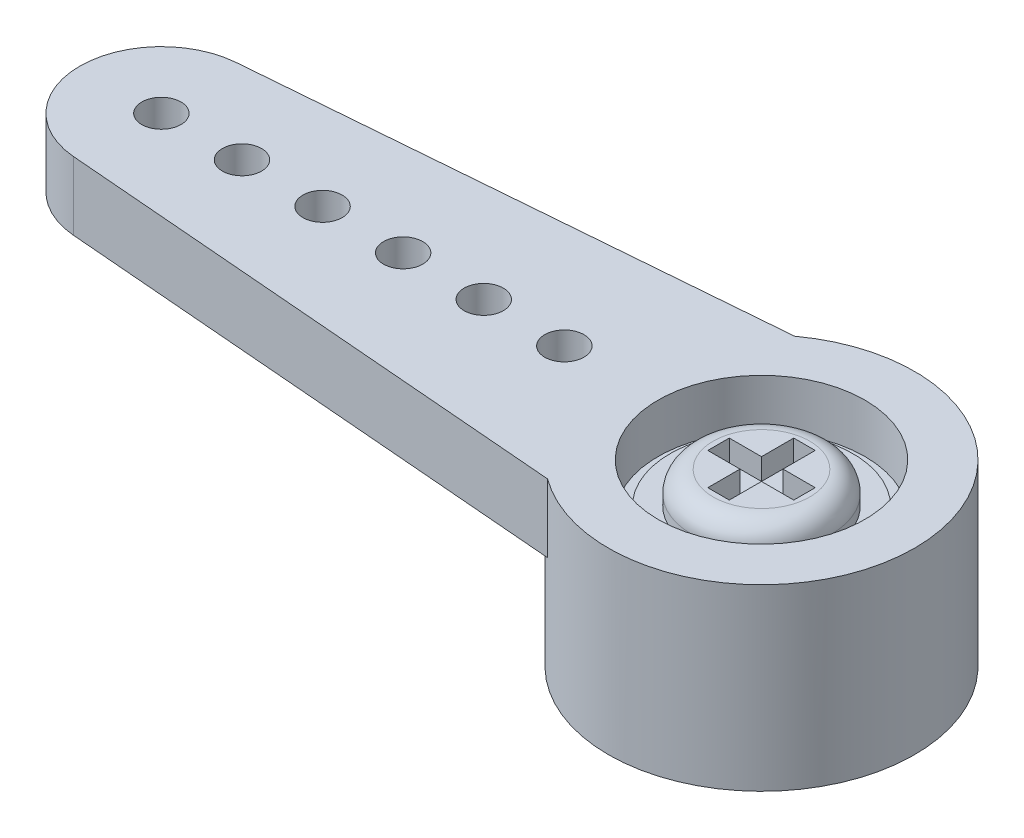
ISO-10303-21;
HEADER;
FILE_DESCRIPTION(('STEP AP214'),'2;1');
FILE_NAME('part.step','',(''),(''),'','','');
FILE_SCHEMA(('AUTOMOTIVE_DESIGN { 1 0 10303 214 1 1 1 1 }'));
ENDSEC;
DATA;
#1=APPLICATION_CONTEXT('core data for automotive mechanical design processes');
#2=APPLICATION_PROTOCOL_DEFINITION('international standard','automotive_design',2000,#1);
#3=PRODUCT_CONTEXT('',#1,'mechanical');
#4=PRODUCT('Part','Part','',(#3));
#5=PRODUCT_RELATED_PRODUCT_CATEGORY('part','',(#4));
#6=PRODUCT_DEFINITION_FORMATION('','',#4);
#7=PRODUCT_DEFINITION_CONTEXT('part definition',#1,'design');
#8=PRODUCT_DEFINITION('design','',#6,#7);
#9=PRODUCT_DEFINITION_SHAPE('','',#8);
#10=(LENGTH_UNIT() NAMED_UNIT(*) SI_UNIT(.MILLI.,.METRE.));
#11=(NAMED_UNIT(*) PLANE_ANGLE_UNIT() SI_UNIT($,.RADIAN.));
#12=(NAMED_UNIT(*) SI_UNIT($,.STERADIAN.) SOLID_ANGLE_UNIT());
#13=UNCERTAINTY_MEASURE_WITH_UNIT(LENGTH_MEASURE(1.E-05),#10,'distance_accuracy_value','');
#14=(GEOMETRIC_REPRESENTATION_CONTEXT(3) GLOBAL_UNCERTAINTY_ASSIGNED_CONTEXT((#13)) GLOBAL_UNIT_ASSIGNED_CONTEXT((#10,
#11,#12)) REPRESENTATION_CONTEXT('',''));
#15=CARTESIAN_POINT('',(0.,0.,0.));
#16=DIRECTION('',(0.,0.,1.));
#17=DIRECTION('',(1.,0.,0.));
#18=AXIS2_PLACEMENT_3D('',#15,#16,#17);
#19=CARTESIAN_POINT('',(0.,0.6604,0.));
#20=DIRECTION('',(0.,1.,0.));
#21=DIRECTION('',(0.,0.,1.));
#22=AXIS2_PLACEMENT_3D('',#19,#20,#21);
#23=PLANE('',#22);
#24=CARTESIAN_POINT('',(0.,0.6604,0.));
#25=DIRECTION('',(0.,1.,0.));
#26=DIRECTION('',(0.,0.,1.));
#27=AXIS2_PLACEMENT_3D('',#24,#25,#26);
#28=CIRCLE('',#27,2.159);
#29=CARTESIAN_POINT('',(0.,0.6604,2.159));
#30=VERTEX_POINT('',#29);
#31=EDGE_CURVE('E264',#30,#30,#28,.T.);
#32=ORIENTED_EDGE('',*,*,#31,.T.);
#33=EDGE_LOOP('',(#32));
#34=FACE_BOUND('',#33,.T.);
#35=CARTESIAN_POINT('',(0.,0.6604,0.));
#36=DIRECTION('',(0.,1.,0.));
#37=DIRECTION('',(0.,0.,1.));
#38=AXIS2_PLACEMENT_3D('',#35,#36,#37);
#39=CIRCLE('',#38,1.651);
#40=CARTESIAN_POINT('',(0.,0.6604,-1.651));
#41=VERTEX_POINT('',#40);
#42=EDGE_CURVE('E241',#41,#41,#39,.T.);
#43=ORIENTED_EDGE('',*,*,#42,.F.);
#44=EDGE_LOOP('',(#43));
#45=FACE_BOUND('',#44,.T.);
#46=ADVANCED_FACE('F34',(#34,#45),#23,.T.);
#47=CARTESIAN_POINT('',(0.,0.4572,0.));
#48=DIRECTION('',(0.,1.,0.));
#49=DIRECTION('',(0.,0.,1.));
#50=AXIS2_PLACEMENT_3D('',#47,#48,#49);
#51=PLANE('',#50);
#52=CARTESIAN_POINT('',(0.,0.4572,0.));
#53=DIRECTION('',(0.,1.,0.));
#54=DIRECTION('',(0.,0.,1.));
#55=AXIS2_PLACEMENT_3D('',#52,#53,#54);
#56=CIRCLE('',#55,2.44475);
#57=CARTESIAN_POINT('',(0.,0.4572,2.44475));
#58=VERTEX_POINT('',#57);
#59=EDGE_CURVE('E276',#58,#58,#56,.T.);
#60=ORIENTED_EDGE('',*,*,#59,.T.);
#61=EDGE_LOOP('',(#60));
#62=FACE_BOUND('',#61,.T.);
#63=CARTESIAN_POINT('',(0.,0.4572,0.));
#64=DIRECTION('',(0.,1.,0.));
#65=DIRECTION('',(0.,0.,1.));
#66=AXIS2_PLACEMENT_3D('',#63,#64,#65);
#67=CIRCLE('',#66,2.159);
#68=CARTESIAN_POINT('',(0.,0.4572,2.159));
#69=VERTEX_POINT('',#68);
#70=EDGE_CURVE('E263',#69,#69,#67,.T.);
#71=ORIENTED_EDGE('',*,*,#70,.F.);
#72=EDGE_LOOP('',(#71));
#73=FACE_BOUND('',#72,.T.);
#74=ADVANCED_FACE('F362',(#62,#73),#51,.T.);
#75=CARTESIAN_POINT('',(0.,-2.6162,0.));
#76=DIRECTION('',(0.,1.,0.));
#77=DIRECTION('',(0.,0.,1.));
#78=AXIS2_PLACEMENT_3D('',#75,#76,#77);
#79=CYLINDRICAL_SURFACE('',#78,1.27);
#80=CARTESIAN_POINT('',(0.,0.4572,0.));
#81=DIRECTION('',(0.,1.,0.));
#82=DIRECTION('',(0.,0.,1.));
#83=AXIS2_PLACEMENT_3D('',#80,#81,#82);
#84=CIRCLE('',#83,1.27);
#85=CARTESIAN_POINT('',(0.,0.4572,1.27));
#86=VERTEX_POINT('',#85);
#87=EDGE_CURVE('E279',#86,#86,#84,.F.);
#88=ORIENTED_EDGE('',*,*,#87,.F.);
#89=EDGE_LOOP('',(#88));
#90=FACE_BOUND('',#89,.T.);
#91=CARTESIAN_POINT('',(0.,-0.2794,0.));
#92=DIRECTION('',(0.,-1.,0.));
#93=DIRECTION('',(0.,0.,-1.));
#94=AXIS2_PLACEMENT_3D('',#91,#92,#93);
#95=CIRCLE('',#94,1.27);
#96=CARTESIAN_POINT('',(0.,-0.2794,-1.27));
#97=VERTEX_POINT('',#96);
#98=EDGE_CURVE('E273',#97,#97,#95,.F.);
#99=ORIENTED_EDGE('',*,*,#98,.F.);
#100=EDGE_LOOP('',(#99));
#101=FACE_BOUND('',#100,.T.);
#102=ADVANCED_FACE('F368',(#90,#101),#79,.F.);
#103=CARTESIAN_POINT('',(0.,1.6129,0.));
#104=DIRECTION('',(0.,-1.,0.));
#105=DIRECTION('',(0.,0.,-1.));
#106=AXIS2_PLACEMENT_3D('',#103,#104,#105);
#107=CYLINDRICAL_SURFACE('',#106,3.6195);
#108=DIRECTION('',(0.,-1.,0.));
#109=VECTOR('',#108,1.);
#110=CARTESIAN_POINT('',(-2.13741415032277,1.6129,2.921));
#111=LINE('',#110,#109);
#112=CARTESIAN_POINT('',(-2.13741415032277,1.6129,2.921));
#113=VERTEX_POINT('',#112);
#114=CARTESIAN_POINT('',(-2.13741415032277,0.,2.921));
#115=VERTEX_POINT('',#114);
#116=EDGE_CURVE('E318',#113,#115,#111,.T.);
#117=ORIENTED_EDGE('',*,*,#116,.T.);
#118=CARTESIAN_POINT('',(0.,0.,0.));
#119=DIRECTION('',(0.,1.,0.));
#120=DIRECTION('',(0.,0.,1.));
#121=AXIS2_PLACEMENT_3D('',#118,#119,#120);
#122=CIRCLE('',#121,3.6195);
#123=CARTESIAN_POINT('',(-2.13741415032277,0.,-2.921));
#124=VERTEX_POINT('',#123);
#125=EDGE_CURVE('E331',#124,#115,#122,.T.);
#126=ORIENTED_EDGE('',*,*,#125,.F.);
#127=DIRECTION('',(0.,-1.,0.));
#128=VECTOR('',#127,1.);
#129=CARTESIAN_POINT('',(-2.13741415032277,1.6129,-2.921));
#130=LINE('',#129,#128);
#131=CARTESIAN_POINT('',(-2.13741415032277,1.6129,-2.921));
#132=VERTEX_POINT('',#131);
#133=EDGE_CURVE('E329',#132,#124,#130,.T.);
#134=ORIENTED_EDGE('',*,*,#133,.F.);
#135=CARTESIAN_POINT('',(0.,1.6129,0.));
#136=DIRECTION('',(0.,1.,0.));
#137=DIRECTION('',(0.,0.,1.));
#138=AXIS2_PLACEMENT_3D('',#135,#136,#137);
#139=CIRCLE('',#138,3.6195);
#140=EDGE_CURVE('E311',#113,#132,#139,.T.);
#141=ORIENTED_EDGE('',*,*,#140,.F.);
#142=EDGE_LOOP('',(#117,#126,#134,#141));
#143=FACE_BOUND('',#142,.T.);
#144=CARTESIAN_POINT('',(0.,-2.6162,0.));
#145=DIRECTION('',(0.,1.,0.));
#146=DIRECTION('',(0.,0.,1.));
#147=AXIS2_PLACEMENT_3D('',#144,#145,#146);
#148=CIRCLE('',#147,3.6195);
#149=CARTESIAN_POINT('',(0.,-2.6162,3.6195));
#150=VERTEX_POINT('',#149);
#151=EDGE_CURVE('E307',#150,#150,#148,.T.);
#152=ORIENTED_EDGE('',*,*,#151,.T.);
#153=EDGE_LOOP('',(#152));
#154=FACE_BOUND('',#153,.T.);
#155=ADVANCED_FACE('F419',(#143,#154),#107,.T.);
#156=CARTESIAN_POINT('',(-14.3430596900559,1.6129,-1.92399194172469));
#157=DIRECTION('',(0.0814130180562945,0.,0.996680450541178));
#158=DIRECTION('',(0.996680450541178,0.,-0.0814130180562945));
#159=AXIS2_PLACEMENT_3D('',#156,#157,#158);
#160=PLANE('',#159);
#161=DIRECTION('',(-0.996680450541178,0.,0.0814130180562945));
#162=VECTOR('',#161,1.);
#163=CARTESIAN_POINT('',(-14.3430596900559,0.,-1.92399194172469));
#164=LINE('',#163,#162);
#165=CARTESIAN_POINT('',(-14.3430596900559,0.,-1.92399194172469));
#166=VERTEX_POINT('',#165);
#167=EDGE_CURVE('E310',#124,#166,#164,.T.);
#168=ORIENTED_EDGE('',*,*,#167,.T.);
#169=DIRECTION('',(0.,-1.,0.));
#170=VECTOR('',#169,1.);
#171=CARTESIAN_POINT('',(-14.3430596900559,1.6129,-1.92399194172469));
#172=LINE('',#171,#170);
#173=CARTESIAN_POINT('',(-14.3430596900559,1.6129,-1.92399194172469));
#174=VERTEX_POINT('',#173);
#175=EDGE_CURVE('E327',#174,#166,#172,.T.);
#176=ORIENTED_EDGE('',*,*,#175,.F.);
#177=DIRECTION('',(-0.996680450541178,0.,0.0814130180562945));
#178=VECTOR('',#177,1.);
#179=CARTESIAN_POINT('',(-14.3430596900559,1.6129,-1.92399194172469));
#180=LINE('',#179,#178);
#181=EDGE_CURVE('E85',#132,#174,#180,.T.);
#182=ORIENTED_EDGE('',*,*,#181,.F.);
#183=ORIENTED_EDGE('',*,*,#133,.T.);
#184=EDGE_LOOP('',(#168,#176,#182,#183));
#185=FACE_BOUND('',#184,.T.);
#186=ADVANCED_FACE('F443',(#185),#160,.F.);
#187=CARTESIAN_POINT('',(-14.1859,1.6129,0.));
#188=DIRECTION('',(0.,-1.,0.));
#189=DIRECTION('',(0.,0.,-1.));
#190=AXIS2_PLACEMENT_3D('',#187,#188,#189);
#191=CYLINDRICAL_SURFACE('',#190,1.9304);
#192=CARTESIAN_POINT('',(-14.1859,0.,0.));
#193=DIRECTION('',(0.,1.,0.));
#194=DIRECTION('',(0.,0.,1.));
#195=AXIS2_PLACEMENT_3D('',#192,#193,#194);
#196=CIRCLE('',#195,1.9304);
#197=CARTESIAN_POINT('',(-14.3430596900559,0.,1.92399194172469));
#198=VERTEX_POINT('',#197);
#199=EDGE_CURVE('E77',#166,#198,#196,.T.);
#200=ORIENTED_EDGE('',*,*,#199,.T.);
#201=DIRECTION('',(0.,-1.,0.));
#202=VECTOR('',#201,1.);
#203=CARTESIAN_POINT('',(-14.3430596900559,1.6129,1.92399194172469));
#204=LINE('',#203,#202);
#205=CARTESIAN_POINT('',(-14.3430596900559,1.6129,1.92399194172469));
#206=VERTEX_POINT('',#205);
#207=EDGE_CURVE('E325',#206,#198,#204,.T.);
#208=ORIENTED_EDGE('',*,*,#207,.F.);
#209=CARTESIAN_POINT('',(-14.1859,1.6129,0.));
#210=DIRECTION('',(0.,1.,0.));
#211=DIRECTION('',(0.,0.,1.));
#212=AXIS2_PLACEMENT_3D('',#209,#210,#211);
#213=CIRCLE('',#212,1.9304);
#214=EDGE_CURVE('E315',#174,#206,#213,.T.);
#215=ORIENTED_EDGE('',*,*,#214,.F.);
#216=ORIENTED_EDGE('',*,*,#175,.T.);
#217=EDGE_LOOP('',(#200,#208,#215,#216));
#218=FACE_BOUND('',#217,.T.);
#219=ADVANCED_FACE('F439',(#218),#191,.T.);
#220=CARTESIAN_POINT('',(-14.3430596900559,1.6129,1.92399194172469));
#221=DIRECTION('',(0.0814130180562943,0.,-0.996680450541178));
#222=DIRECTION('',(-0.996680450541178,0.,-0.0814130180562943));
#223=AXIS2_PLACEMENT_3D('',#220,#221,#222);
#224=PLANE('',#223);
#225=DIRECTION('',(0.996680450541178,0.,0.0814130180562943));
#226=VECTOR('',#225,1.);
#227=CARTESIAN_POINT('',(-14.3430596900559,0.,1.92399194172469));
#228=LINE('',#227,#226);
#229=EDGE_CURVE('E313',#198,#115,#228,.T.);
#230=ORIENTED_EDGE('',*,*,#229,.T.);
#231=ORIENTED_EDGE('',*,*,#116,.F.);
#232=DIRECTION('',(0.996680450541178,0.,0.0814130180562943));
#233=VECTOR('',#232,1.);
#234=CARTESIAN_POINT('',(-14.3430596900559,1.6129,1.92399194172469));
#235=LINE('',#234,#233);
#236=EDGE_CURVE('E58',#206,#113,#235,.T.);
#237=ORIENTED_EDGE('',*,*,#236,.F.);
#238=ORIENTED_EDGE('',*,*,#207,.T.);
#239=EDGE_LOOP('',(#230,#231,#237,#238));
#240=FACE_BOUND('',#239,.T.);
#241=ADVANCED_FACE('F432',(#240),#224,.F.);
#242=CARTESIAN_POINT('',(0.,1.6129,0.));
#243=DIRECTION('',(0.,1.,0.));
#244=DIRECTION('',(0.,0.,1.));
#245=AXIS2_PLACEMENT_3D('',#242,#243,#244);
#246=PLANE('',#245);
#247=CARTESIAN_POINT('',(0.,1.6129,0.));
#248=DIRECTION('',(0.,1.,0.));
#249=DIRECTION('',(0.,0.,1.));
#250=AXIS2_PLACEMENT_3D('',#247,#248,#249);
#251=CIRCLE('',#250,2.44475);
#252=CARTESIAN_POINT('',(0.,1.6129,2.44475));
#253=VERTEX_POINT('',#252);
#254=EDGE_CURVE('E280',#253,#253,#251,.T.);
#255=ORIENTED_EDGE('',*,*,#254,.F.);
#256=EDGE_LOOP('',(#255));
#257=FACE_BOUND('',#256,.T.);
#258=CARTESIAN_POINT('',(-12.2809,1.6129,0.));
#259=DIRECTION('',(0.,1.,0.));
#260=DIRECTION('',(0.,0.,1.));
#261=AXIS2_PLACEMENT_3D('',#258,#259,#260);
#262=CIRCLE('',#261,0.46355);
#263=CARTESIAN_POINT('',(-12.2809,1.6129,0.46355));
#264=VERTEX_POINT('',#263);
#265=EDGE_CURVE('E283',#264,#264,#262,.T.);
#266=ORIENTED_EDGE('',*,*,#265,.F.);
#267=EDGE_LOOP('',(#266));
#268=FACE_BOUND('',#267,.T.);
#269=CARTESIAN_POINT('',(-10.3759,1.6129,0.));
#270=DIRECTION('',(0.,1.,0.));
#271=DIRECTION('',(0.,0.,1.));
#272=AXIS2_PLACEMENT_3D('',#269,#270,#271);
#273=CIRCLE('',#272,0.46355);
#274=CARTESIAN_POINT('',(-10.3759,1.6129,0.46355));
#275=VERTEX_POINT('',#274);
#276=EDGE_CURVE('E287',#275,#275,#273,.T.);
#277=ORIENTED_EDGE('',*,*,#276,.F.);
#278=EDGE_LOOP('',(#277));
#279=FACE_BOUND('',#278,.T.);
#280=CARTESIAN_POINT('',(-8.4709,1.6129,0.));
#281=DIRECTION('',(0.,1.,0.));
#282=DIRECTION('',(0.,0.,1.));
#283=AXIS2_PLACEMENT_3D('',#280,#281,#282);
#284=CIRCLE('',#283,0.46355);
#285=CARTESIAN_POINT('',(-8.4709,1.6129,0.46355));
#286=VERTEX_POINT('',#285);
#287=EDGE_CURVE('E291',#286,#286,#284,.T.);
#288=ORIENTED_EDGE('',*,*,#287,.F.);
#289=EDGE_LOOP('',(#288));
#290=FACE_BOUND('',#289,.T.);
#291=CARTESIAN_POINT('',(-6.5659,1.6129,0.));
#292=DIRECTION('',(0.,1.,0.));
#293=DIRECTION('',(0.,0.,1.));
#294=AXIS2_PLACEMENT_3D('',#291,#292,#293);
#295=CIRCLE('',#294,0.46355);
#296=CARTESIAN_POINT('',(-6.5659,1.6129,0.46355));
#297=VERTEX_POINT('',#296);
#298=EDGE_CURVE('E295',#297,#297,#295,.T.);
#299=ORIENTED_EDGE('',*,*,#298,.F.);
#300=EDGE_LOOP('',(#299));
#301=FACE_BOUND('',#300,.T.);
#302=CARTESIAN_POINT('',(-4.6609,1.6129,0.));
#303=DIRECTION('',(0.,1.,0.));
#304=DIRECTION('',(0.,0.,1.));
#305=AXIS2_PLACEMENT_3D('',#302,#303,#304);
#306=CIRCLE('',#305,0.46355);
#307=CARTESIAN_POINT('',(-4.6609,1.6129,0.46355));
#308=VERTEX_POINT('',#307);
#309=EDGE_CURVE('E299',#308,#308,#306,.T.);
#310=ORIENTED_EDGE('',*,*,#309,.F.);
#311=EDGE_LOOP('',(#310));
#312=FACE_BOUND('',#311,.T.);
#313=CARTESIAN_POINT('',(-14.1859,1.6129,0.));
#314=DIRECTION('',(0.,1.,0.));
#315=DIRECTION('',(0.,0.,1.));
#316=AXIS2_PLACEMENT_3D('',#313,#314,#315);
#317=CIRCLE('',#316,0.46355);
#318=CARTESIAN_POINT('',(-14.1859,1.6129,0.463550000000002));
#319=VERTEX_POINT('',#318);
#320=EDGE_CURVE('E303',#319,#319,#317,.T.);
#321=ORIENTED_EDGE('',*,*,#320,.F.);
#322=EDGE_LOOP('',(#321));
#323=FACE_BOUND('',#322,.T.);
#324=ORIENTED_EDGE('',*,*,#236,.T.);
#325=ORIENTED_EDGE('',*,*,#140,.T.);
#326=ORIENTED_EDGE('',*,*,#181,.T.);
#327=ORIENTED_EDGE('',*,*,#214,.T.);
#328=EDGE_LOOP('',(#324,#325,#326,#327));
#329=FACE_BOUND('',#328,.T.);
#330=ADVANCED_FACE('F429',(#257,#268,#279,#290,#301,#312,#323,#329),#246,.T.);
#331=CARTESIAN_POINT('',(0.,0.,0.));
#332=DIRECTION('',(0.,1.,0.));
#333=DIRECTION('',(0.,0.,1.));
#334=AXIS2_PLACEMENT_3D('',#331,#332,#333);
#335=PLANE('',#334);
#336=CARTESIAN_POINT('',(-12.2809,0.,0.));
#337=DIRECTION('',(0.,1.,0.));
#338=DIRECTION('',(0.,0.,1.));
#339=AXIS2_PLACEMENT_3D('',#336,#337,#338);
#340=CIRCLE('',#339,0.46355);
#341=CARTESIAN_POINT('',(-12.2809,0.,0.46355));
#342=VERTEX_POINT('',#341);
#343=EDGE_CURVE('E286',#342,#342,#340,.T.);
#344=ORIENTED_EDGE('',*,*,#343,.T.);
#345=EDGE_LOOP('',(#344));
#346=FACE_BOUND('',#345,.T.);
#347=CARTESIAN_POINT('',(-10.3759,0.,0.));
#348=DIRECTION('',(0.,1.,0.));
#349=DIRECTION('',(0.,0.,1.));
#350=AXIS2_PLACEMENT_3D('',#347,#348,#349);
#351=CIRCLE('',#350,0.46355);
#352=CARTESIAN_POINT('',(-10.3759,0.,0.46355));
#353=VERTEX_POINT('',#352);
#354=EDGE_CURVE('E290',#353,#353,#351,.T.);
#355=ORIENTED_EDGE('',*,*,#354,.T.);
#356=EDGE_LOOP('',(#355));
#357=FACE_BOUND('',#356,.T.);
#358=CARTESIAN_POINT('',(-8.4709,0.,0.));
#359=DIRECTION('',(0.,1.,0.));
#360=DIRECTION('',(0.,0.,1.));
#361=AXIS2_PLACEMENT_3D('',#358,#359,#360);
#362=CIRCLE('',#361,0.46355);
#363=CARTESIAN_POINT('',(-8.4709,0.,0.46355));
#364=VERTEX_POINT('',#363);
#365=EDGE_CURVE('E294',#364,#364,#362,.T.);
#366=ORIENTED_EDGE('',*,*,#365,.T.);
#367=EDGE_LOOP('',(#366));
#368=FACE_BOUND('',#367,.T.);
#369=CARTESIAN_POINT('',(-6.5659,0.,0.));
#370=DIRECTION('',(0.,1.,0.));
#371=DIRECTION('',(0.,0.,1.));
#372=AXIS2_PLACEMENT_3D('',#369,#370,#371);
#373=CIRCLE('',#372,0.46355);
#374=CARTESIAN_POINT('',(-6.5659,0.,0.46355));
#375=VERTEX_POINT('',#374);
#376=EDGE_CURVE('E298',#375,#375,#373,.T.);
#377=ORIENTED_EDGE('',*,*,#376,.T.);
#378=EDGE_LOOP('',(#377));
#379=FACE_BOUND('',#378,.T.);
#380=CARTESIAN_POINT('',(-4.6609,0.,0.));
#381=DIRECTION('',(0.,1.,0.));
#382=DIRECTION('',(0.,0.,1.));
#383=AXIS2_PLACEMENT_3D('',#380,#381,#382);
#384=CIRCLE('',#383,0.46355);
#385=CARTESIAN_POINT('',(-4.6609,0.,0.46355));
#386=VERTEX_POINT('',#385);
#387=EDGE_CURVE('E302',#386,#386,#384,.T.);
#388=ORIENTED_EDGE('',*,*,#387,.T.);
#389=EDGE_LOOP('',(#388));
#390=FACE_BOUND('',#389,.T.);
#391=CARTESIAN_POINT('',(-14.1859,0.,0.));
#392=DIRECTION('',(0.,1.,0.));
#393=DIRECTION('',(0.,0.,1.));
#394=AXIS2_PLACEMENT_3D('',#391,#392,#393);
#395=CIRCLE('',#394,0.46355);
#396=CARTESIAN_POINT('',(-14.1859,0.,0.463550000000002));
#397=VERTEX_POINT('',#396);
#398=EDGE_CURVE('E306',#397,#397,#395,.T.);
#399=ORIENTED_EDGE('',*,*,#398,.T.);
#400=EDGE_LOOP('',(#399));
#401=FACE_BOUND('',#400,.T.);
#402=ORIENTED_EDGE('',*,*,#167,.F.);
#403=ORIENTED_EDGE('',*,*,#125,.T.);
#404=ORIENTED_EDGE('',*,*,#229,.F.);
#405=ORIENTED_EDGE('',*,*,#199,.F.);
#406=EDGE_LOOP('',(#402,#403,#404,#405));
#407=FACE_BOUND('',#406,.T.);
#408=ADVANCED_FACE('F427',(#346,#357,#368,#379,#390,#401,#407),#335,.F.);
#409=CARTESIAN_POINT('',(0.,-2.6162,0.));
#410=DIRECTION('',(0.,1.,0.));
#411=DIRECTION('',(0.,0.,1.));
#412=AXIS2_PLACEMENT_3D('',#409,#410,#411);
#413=PLANE('',#412);
#414=CARTESIAN_POINT('',(0.,-2.6162,0.));
#415=DIRECTION('',(0.,-1.,0.));
#416=DIRECTION('',(0.,0.,-1.));
#417=AXIS2_PLACEMENT_3D('',#414,#415,#416);
#418=CIRCLE('',#417,2.286);
#419=CARTESIAN_POINT('',(0.,-2.6162,-2.286));
#420=VERTEX_POINT('',#419);
#421=EDGE_CURVE('E267',#420,#420,#418,.T.);
#422=ORIENTED_EDGE('',*,*,#421,.F.);
#423=EDGE_LOOP('',(#422));
#424=FACE_BOUND('',#423,.T.);
#425=ORIENTED_EDGE('',*,*,#151,.F.);
#426=EDGE_LOOP('',(#425));
#427=FACE_BOUND('',#426,.T.);
#428=ADVANCED_FACE('F423',(#424,#427),#413,.F.);
#429=CARTESIAN_POINT('',(-14.1859,-2.6162,0.));
#430=DIRECTION('',(0.,1.,0.));
#431=DIRECTION('',(0.,0.,1.));
#432=AXIS2_PLACEMENT_3D('',#429,#430,#431);
#433=CYLINDRICAL_SURFACE('',#432,0.46355);
#434=ORIENTED_EDGE('',*,*,#320,.T.);
#435=EDGE_LOOP('',(#434));
#436=FACE_BOUND('',#435,.T.);
#437=ORIENTED_EDGE('',*,*,#398,.F.);
#438=EDGE_LOOP('',(#437));
#439=FACE_BOUND('',#438,.T.);
#440=ADVANCED_FACE('F415',(#436,#439),#433,.F.);
#441=CARTESIAN_POINT('',(-4.6609,-2.6162,0.));
#442=DIRECTION('',(0.,1.,0.));
#443=DIRECTION('',(0.,0.,1.));
#444=AXIS2_PLACEMENT_3D('',#441,#442,#443);
#445=CYLINDRICAL_SURFACE('',#444,0.46355);
#446=ORIENTED_EDGE('',*,*,#309,.T.);
#447=EDGE_LOOP('',(#446));
#448=FACE_BOUND('',#447,.T.);
#449=ORIENTED_EDGE('',*,*,#387,.F.);
#450=EDGE_LOOP('',(#449));
#451=FACE_BOUND('',#450,.T.);
#452=ADVANCED_FACE('F411',(#448,#451),#445,.F.);
#453=CARTESIAN_POINT('',(-6.5659,-2.6162,0.));
#454=DIRECTION('',(0.,1.,0.));
#455=DIRECTION('',(0.,0.,1.));
#456=AXIS2_PLACEMENT_3D('',#453,#454,#455);
#457=CYLINDRICAL_SURFACE('',#456,0.46355);
#458=ORIENTED_EDGE('',*,*,#298,.T.);
#459=EDGE_LOOP('',(#458));
#460=FACE_BOUND('',#459,.T.);
#461=ORIENTED_EDGE('',*,*,#376,.F.);
#462=EDGE_LOOP('',(#461));
#463=FACE_BOUND('',#462,.T.);
#464=ADVANCED_FACE('F407',(#460,#463),#457,.F.);
#465=CARTESIAN_POINT('',(-8.4709,-2.6162,0.));
#466=DIRECTION('',(0.,1.,0.));
#467=DIRECTION('',(0.,0.,1.));
#468=AXIS2_PLACEMENT_3D('',#465,#466,#467);
#469=CYLINDRICAL_SURFACE('',#468,0.46355);
#470=ORIENTED_EDGE('',*,*,#287,.T.);
#471=EDGE_LOOP('',(#470));
#472=FACE_BOUND('',#471,.T.);
#473=ORIENTED_EDGE('',*,*,#365,.F.);
#474=EDGE_LOOP('',(#473));
#475=FACE_BOUND('',#474,.T.);
#476=ADVANCED_FACE('F403',(#472,#475),#469,.F.);
#477=CARTESIAN_POINT('',(-10.3759,-2.6162,0.));
#478=DIRECTION('',(0.,1.,0.));
#479=DIRECTION('',(0.,0.,1.));
#480=AXIS2_PLACEMENT_3D('',#477,#478,#479);
#481=CYLINDRICAL_SURFACE('',#480,0.46355);
#482=ORIENTED_EDGE('',*,*,#276,.T.);
#483=EDGE_LOOP('',(#482));
#484=FACE_BOUND('',#483,.T.);
#485=ORIENTED_EDGE('',*,*,#354,.F.);
#486=EDGE_LOOP('',(#485));
#487=FACE_BOUND('',#486,.T.);
#488=ADVANCED_FACE('F399',(#484,#487),#481,.F.);
#489=CARTESIAN_POINT('',(-12.2809,-2.6162,0.));
#490=DIRECTION('',(0.,1.,0.));
#491=DIRECTION('',(0.,0.,1.));
#492=AXIS2_PLACEMENT_3D('',#489,#490,#491);
#493=CYLINDRICAL_SURFACE('',#492,0.46355);
#494=ORIENTED_EDGE('',*,*,#265,.T.);
#495=EDGE_LOOP('',(#494));
#496=FACE_BOUND('',#495,.T.);
#497=ORIENTED_EDGE('',*,*,#343,.F.);
#498=EDGE_LOOP('',(#497));
#499=FACE_BOUND('',#498,.T.);
#500=ADVANCED_FACE('F395',(#496,#499),#493,.F.);
#501=CARTESIAN_POINT('',(0.,0.4572,0.));
#502=DIRECTION('',(0.,1.,0.));
#503=DIRECTION('',(0.,0.,1.));
#504=AXIS2_PLACEMENT_3D('',#501,#502,#503);
#505=CYLINDRICAL_SURFACE('',#504,2.44475);
#506=ORIENTED_EDGE('',*,*,#59,.F.);
#507=EDGE_LOOP('',(#506));
#508=FACE_BOUND('',#507,.T.);
#509=ORIENTED_EDGE('',*,*,#254,.T.);
#510=EDGE_LOOP('',(#509));
#511=FACE_BOUND('',#510,.T.);
#512=ADVANCED_FACE('F388',(#508,#511),#505,.F.);
#513=CARTESIAN_POINT('',(0.,-0.2794,0.));
#514=DIRECTION('',(0.,-1.,0.));
#515=DIRECTION('',(0.,0.,-1.));
#516=AXIS2_PLACEMENT_3D('',#513,#514,#515);
#517=PLANE('',#516);
#518=CARTESIAN_POINT('',(0.,-0.2794,0.));
#519=DIRECTION('',(0.,-1.,0.));
#520=DIRECTION('',(0.,0.,-1.));
#521=AXIS2_PLACEMENT_3D('',#518,#519,#520);
#522=CIRCLE('',#521,2.286);
#523=CARTESIAN_POINT('',(0.,-0.2794,-2.286));
#524=VERTEX_POINT('',#523);
#525=EDGE_CURVE('E270',#524,#524,#522,.T.);
#526=ORIENTED_EDGE('',*,*,#525,.T.);
#527=EDGE_LOOP('',(#526));
#528=FACE_BOUND('',#527,.T.);
#529=ORIENTED_EDGE('',*,*,#98,.T.);
#530=EDGE_LOOP('',(#529));
#531=FACE_BOUND('',#530,.T.);
#532=ADVANCED_FACE('F385',(#528,#531),#517,.T.);
#533=CARTESIAN_POINT('',(0.,-0.2794,0.));
#534=DIRECTION('',(0.,-1.,0.));
#535=DIRECTION('',(0.,0.,-1.));
#536=AXIS2_PLACEMENT_3D('',#533,#534,#535);
#537=CYLINDRICAL_SURFACE('',#536,2.286);
#538=ORIENTED_EDGE('',*,*,#525,.F.);
#539=EDGE_LOOP('',(#538));
#540=FACE_BOUND('',#539,.T.);
#541=ORIENTED_EDGE('',*,*,#421,.T.);
#542=EDGE_LOOP('',(#541));
#543=FACE_BOUND('',#542,.T.);
#544=ADVANCED_FACE('F383',(#540,#543),#537,.F.);
#545=CARTESIAN_POINT('',(0.,0.6604,0.));
#546=DIRECTION('',(0.,-1.,0.));
#547=DIRECTION('',(0.,0.,-1.));
#548=AXIS2_PLACEMENT_3D('',#545,#546,#547);
#549=CYLINDRICAL_SURFACE('',#548,2.159);
#550=ORIENTED_EDGE('',*,*,#31,.F.);
#551=EDGE_LOOP('',(#550));
#552=FACE_BOUND('',#551,.T.);
#553=ORIENTED_EDGE('',*,*,#70,.T.);
#554=EDGE_LOOP('',(#553));
#555=FACE_BOUND('',#554,.T.);
#556=ADVANCED_FACE('F379',(#552,#555),#549,.T.);
#557=CARTESIAN_POINT('',(0.,0.4572,0.));
#558=DIRECTION('',(0.,1.,0.));
#559=DIRECTION('',(0.,0.,1.));
#560=AXIS2_PLACEMENT_3D('',#557,#558,#559);
#561=PLANE('',#560);
#562=ORIENTED_EDGE('',*,*,#87,.T.);
#563=EDGE_LOOP('',(#562));
#564=FACE_BOUND('',#563,.T.);
#565=ADVANCED_FACE('F376',(#564),#561,.F.);
#566=CARTESIAN_POINT('',(0.,1.4224,0.));
#567=DIRECTION('',(0.,-1.,0.));
#568=DIRECTION('',(0.,0.,-1.));
#569=AXIS2_PLACEMENT_3D('',#566,#567,#568);
#570=CYLINDRICAL_SURFACE('',#569,1.651);
#571=CARTESIAN_POINT('',(0.,0.9144,0.));
#572=DIRECTION('',(0.,1.,0.));
#573=DIRECTION('',(0.,0.,1.));
#574=AXIS2_PLACEMENT_3D('',#571,#572,#573);
#575=CIRCLE('',#574,1.651);
#576=CARTESIAN_POINT('',(0.,0.9144,-1.651));
#577=VERTEX_POINT('',#576);
#578=EDGE_CURVE('E11',#577,#577,#575,.F.);
#579=CARTESIAN_POINT('',(0.,0.9144,-1.651));
#580=CARTESIAN_POINT('',(0.,0.911754166666666,-1.651));
#581=CARTESIAN_POINT('',(0.,0.909108333333333,-1.651));
#582=CARTESIAN_POINT('',(0.,0.903816666666666,-1.651));
#583=CARTESIAN_POINT('',(0.,0.901170833333333,-1.651));
#584=CARTESIAN_POINT('',(0.,0.895879166666666,-1.651));
#585=CARTESIAN_POINT('',(0.,0.893233333333333,-1.651));
#586=CARTESIAN_POINT('',(0.,0.887941666666667,-1.651));
#587=CARTESIAN_POINT('',(0.,0.885295833333333,-1.651));
#588=CARTESIAN_POINT('',(0.,0.880004166666666,-1.651));
#589=CARTESIAN_POINT('',(0.,0.877358333333333,-1.651));
#590=CARTESIAN_POINT('',(0.,0.872066666666666,-1.651));
#591=CARTESIAN_POINT('',(0.,0.869420833333333,-1.651));
#592=CARTESIAN_POINT('',(0.,0.864129166666667,-1.651));
#593=CARTESIAN_POINT('',(0.,0.861483333333333,-1.651));
#594=CARTESIAN_POINT('',(0.,0.856191666666666,-1.651));
#595=CARTESIAN_POINT('',(0.,0.853545833333333,-1.651));
#596=CARTESIAN_POINT('',(0.,0.848254166666666,-1.651));
#597=CARTESIAN_POINT('',(0.,0.845608333333333,-1.651));
#598=CARTESIAN_POINT('',(0.,0.840316666666666,-1.651));
#599=CARTESIAN_POINT('',(0.,0.837670833333333,-1.651));
#600=CARTESIAN_POINT('',(0.,0.832379166666666,-1.651));
#601=CARTESIAN_POINT('',(0.,0.829733333333333,-1.651));
#602=CARTESIAN_POINT('',(0.,0.824441666666667,-1.651));
#603=CARTESIAN_POINT('',(0.,0.821795833333333,-1.651));
#604=CARTESIAN_POINT('',(0.,0.816504166666666,-1.651));
#605=CARTESIAN_POINT('',(0.,0.813858333333333,-1.651));
#606=CARTESIAN_POINT('',(0.,0.808566666666666,-1.651));
#607=CARTESIAN_POINT('',(0.,0.805920833333333,-1.651));
#608=CARTESIAN_POINT('',(0.,0.800629166666667,-1.651));
#609=CARTESIAN_POINT('',(0.,0.797983333333333,-1.651));
#610=CARTESIAN_POINT('',(0.,0.792691666666667,-1.651));
#611=CARTESIAN_POINT('',(0.,0.790045833333333,-1.651));
#612=CARTESIAN_POINT('',(0.,0.784754166666667,-1.651));
#613=CARTESIAN_POINT('',(0.,0.782108333333333,-1.651));
#614=CARTESIAN_POINT('',(0.,0.776816666666666,-1.651));
#615=CARTESIAN_POINT('',(0.,0.774170833333333,-1.651));
#616=CARTESIAN_POINT('',(0.,0.768879166666666,-1.651));
#617=CARTESIAN_POINT('',(0.,0.766233333333333,-1.651));
#618=CARTESIAN_POINT('',(0.,0.760941666666667,-1.651));
#619=CARTESIAN_POINT('',(0.,0.758295833333333,-1.651));
#620=CARTESIAN_POINT('',(0.,0.753004166666666,-1.651));
#621=CARTESIAN_POINT('',(0.,0.750358333333333,-1.651));
#622=CARTESIAN_POINT('',(0.,0.745066666666667,-1.651));
#623=CARTESIAN_POINT('',(0.,0.742420833333333,-1.651));
#624=CARTESIAN_POINT('',(0.,0.737129166666667,-1.651));
#625=CARTESIAN_POINT('',(0.,0.734483333333333,-1.651));
#626=CARTESIAN_POINT('',(0.,0.729191666666667,-1.651));
#627=CARTESIAN_POINT('',(0.,0.726545833333333,-1.651));
#628=CARTESIAN_POINT('',(0.,0.721254166666667,-1.651));
#629=CARTESIAN_POINT('',(0.,0.718608333333333,-1.651));
#630=CARTESIAN_POINT('',(0.,0.713316666666666,-1.651));
#631=CARTESIAN_POINT('',(0.,0.710670833333333,-1.651));
#632=CARTESIAN_POINT('',(0.,0.705379166666666,-1.651));
#633=CARTESIAN_POINT('',(0.,0.702733333333333,-1.651));
#634=CARTESIAN_POINT('',(0.,0.697441666666667,-1.651));
#635=CARTESIAN_POINT('',(0.,0.694795833333333,-1.651));
#636=CARTESIAN_POINT('',(0.,0.689504166666667,-1.651));
#637=CARTESIAN_POINT('',(0.,0.686858333333333,-1.651));
#638=CARTESIAN_POINT('',(0.,0.681566666666667,-1.651));
#639=CARTESIAN_POINT('',(0.,0.678920833333333,-1.651));
#640=CARTESIAN_POINT('',(0.,0.673629166666667,-1.651));
#641=CARTESIAN_POINT('',(0.,0.670983333333333,-1.651));
#642=CARTESIAN_POINT('',(0.,0.665691666666667,-1.651));
#643=CARTESIAN_POINT('',(0.,0.663045833333333,-1.651));
#644=CARTESIAN_POINT('',(0.,0.6604,-1.651));
#645=B_SPLINE_CURVE_WITH_KNOTS('',3,(#579,#580,#581,#582,#583,#584,#585,#586,#587,#588,#589,
#590,#591,#592,#593,#594,#595,#596,#597,#598,#599,#600,#601,#602,#603,#604,#605,#606,#607,#608,
#609,#610,#611,#612,#613,#614,#615,#616,#617,#618,#619,#620,#621,#622,#623,#624,#625,#626,#627,
#628,#629,#630,#631,#632,#633,#634,#635,#636,#637,#638,#639,#640,#641,#642,#643,#644),
.UNSPECIFIED.,.F.,.F.,(4,2,2,2,2,2,2,2,2,2,2,2,2,2,2,2,2,2,2,2,2,2,2,2,2,2,2,2,2,2,2,2,4),(0.,
0.00793750000000002,0.015875,0.0238125,0.03175,0.0396875,0.0476249999999999,0.0555624999999999,
0.0635,0.0714375,0.079375,0.0873124999999999,0.09525,0.1031875,0.111125,0.1190625,0.127,
0.1349375,0.142875,0.1508125,0.15875,0.1666875,0.174625,0.1825625,0.1905,0.1984375,0.206375,
0.2143125,0.22225,0.2301875,0.238125,0.2460625,0.254),.UNSPECIFIED.);
#646=EDGE_CURVE('BSEAM374',#577,#41,#645,.T.);
#647=ORIENTED_EDGE('',*,*,#578,.T.);
#648=ORIENTED_EDGE('',*,*,#42,.T.);
#649=ORIENTED_EDGE('',*,*,#646,.T.);
#650=ORIENTED_EDGE('',*,*,#646,.F.);
#651=EDGE_LOOP('',(#647,#649,#648,#650));
#652=FACE_BOUND('',#651,.T.);
#653=ADVANCED_FACE('F374',(#652),#570,.T.);
#654=CARTESIAN_POINT('',(0.,1.4224,0.));
#655=DIRECTION('',(0.,1.,0.));
#656=DIRECTION('',(0.,0.,1.));
#657=AXIS2_PLACEMENT_3D('',#654,#655,#656);
#658=PLANE('',#657);
#659=CARTESIAN_POINT('',(0.,1.4224,0.));
#660=DIRECTION('',(0.,1.,0.));
#661=DIRECTION('',(0.,0.,1.));
#662=AXIS2_PLACEMENT_3D('',#659,#660,#661);
#663=CIRCLE('',#662,1.143);
#664=CARTESIAN_POINT('',(0.,1.4224,1.143));
#665=VERTEX_POINT('',#664);
#666=EDGE_CURVE('E42',#665,#665,#663,.T.);
#667=ORIENTED_EDGE('',*,*,#666,.T.);
#668=EDGE_LOOP('',(#667));
#669=FACE_BOUND('',#668,.T.);
#670=DIRECTION('',(1.,0.,0.));
#671=VECTOR('',#670,1.);
#672=CARTESIAN_POINT('',(0.254,1.4224,0.254));
#673=LINE('',#672,#671);
#674=CARTESIAN_POINT('',(0.254,1.4224,0.254));
#675=VERTEX_POINT('',#674);
#676=CARTESIAN_POINT('',(1.016,1.4224,0.254000000000001));
#677=VERTEX_POINT('',#676);
#678=EDGE_CURVE('E49',#675,#677,#673,.T.);
#679=ORIENTED_EDGE('',*,*,#678,.F.);
#680=DIRECTION('',(0.,0.,-1.));
#681=VECTOR('',#680,1.);
#682=CARTESIAN_POINT('',(0.254,1.4224,1.016));
#683=LINE('',#682,#681);
#684=CARTESIAN_POINT('',(0.254,1.4224,1.016));
#685=VERTEX_POINT('',#684);
#686=EDGE_CURVE('E179',#685,#675,#683,.T.);
#687=ORIENTED_EDGE('',*,*,#686,.F.);
#688=DIRECTION('',(1.,0.,0.));
#689=VECTOR('',#688,1.);
#690=CARTESIAN_POINT('',(0.254,1.4224,1.016));
#691=LINE('',#690,#689);
#692=CARTESIAN_POINT('',(-0.254,1.4224,1.016));
#693=VERTEX_POINT('',#692);
#694=EDGE_CURVE('E182',#693,#685,#691,.T.);
#695=ORIENTED_EDGE('',*,*,#694,.F.);
#696=DIRECTION('',(0.,0.,1.));
#697=VECTOR('',#696,1.);
#698=CARTESIAN_POINT('',(-0.254,1.4224,1.016));
#699=LINE('',#698,#697);
#700=CARTESIAN_POINT('',(-0.254,1.4224,0.254));
#701=VERTEX_POINT('',#700);
#702=EDGE_CURVE('E234',#701,#693,#699,.T.);
#703=ORIENTED_EDGE('',*,*,#702,.F.);
#704=DIRECTION('',(1.,0.,0.));
#705=VECTOR('',#704,1.);
#706=CARTESIAN_POINT('',(-0.254,1.4224,0.254));
#707=LINE('',#706,#705);
#708=CARTESIAN_POINT('',(-1.016,1.4224,0.254));
#709=VERTEX_POINT('',#708);
#710=EDGE_CURVE('E231',#709,#701,#707,.T.);
#711=ORIENTED_EDGE('',*,*,#710,.F.);
#712=DIRECTION('',(0.,0.,1.));
#713=VECTOR('',#712,1.);
#714=CARTESIAN_POINT('',(-1.016,1.4224,0.254));
#715=LINE('',#714,#713);
#716=CARTESIAN_POINT('',(-1.016,1.4224,-0.254000000000001));
#717=VERTEX_POINT('',#716);
#718=EDGE_CURVE('E228',#717,#709,#715,.T.);
#719=ORIENTED_EDGE('',*,*,#718,.F.);
#720=DIRECTION('',(-1.,0.,0.));
#721=VECTOR('',#720,1.);
#722=CARTESIAN_POINT('',(-0.254,1.4224,-0.254));
#723=LINE('',#722,#721);
#724=CARTESIAN_POINT('',(-0.254,1.4224,-0.254));
#725=VERTEX_POINT('',#724);
#726=EDGE_CURVE('E225',#725,#717,#723,.T.);
#727=ORIENTED_EDGE('',*,*,#726,.F.);
#728=DIRECTION('',(0.,0.,1.));
#729=VECTOR('',#728,1.);
#730=CARTESIAN_POINT('',(-0.254000000000001,1.4224,-1.016));
#731=LINE('',#730,#729);
#732=CARTESIAN_POINT('',(-0.254000000000001,1.4224,-1.016));
#733=VERTEX_POINT('',#732);
#734=EDGE_CURVE('E222',#733,#725,#731,.T.);
#735=ORIENTED_EDGE('',*,*,#734,.F.);
#736=DIRECTION('',(-1.,0.,0.));
#737=VECTOR('',#736,1.);
#738=CARTESIAN_POINT('',(0.254,1.4224,-1.016));
#739=LINE('',#738,#737);
#740=CARTESIAN_POINT('',(0.254,1.4224,-1.016));
#741=VERTEX_POINT('',#740);
#742=EDGE_CURVE('E219',#741,#733,#739,.T.);
#743=ORIENTED_EDGE('',*,*,#742,.F.);
#744=DIRECTION('',(0.,0.,-1.));
#745=VECTOR('',#744,1.);
#746=CARTESIAN_POINT('',(0.254,1.4224,-1.016));
#747=LINE('',#746,#745);
#748=CARTESIAN_POINT('',(0.254,1.4224,-0.254));
#749=VERTEX_POINT('',#748);
#750=EDGE_CURVE('E216',#749,#741,#747,.T.);
#751=ORIENTED_EDGE('',*,*,#750,.F.);
#752=DIRECTION('',(-1.,0.,0.));
#753=VECTOR('',#752,1.);
#754=CARTESIAN_POINT('',(0.254,1.4224,-0.254));
#755=LINE('',#754,#753);
#756=CARTESIAN_POINT('',(1.016,1.4224,-0.254000000000001));
#757=VERTEX_POINT('',#756);
#758=EDGE_CURVE('E213',#757,#749,#755,.T.);
#759=ORIENTED_EDGE('',*,*,#758,.F.);
#760=DIRECTION('',(0.,0.,-1.));
#761=VECTOR('',#760,1.);
#762=CARTESIAN_POINT('',(1.016,1.4224,0.254000000000001));
#763=LINE('',#762,#761);
#764=EDGE_CURVE('E211',#677,#757,#763,.T.);
#765=ORIENTED_EDGE('',*,*,#764,.F.);
#766=EDGE_LOOP('',(#679,#687,#695,#703,#711,#719,#727,#735,#743,#751,#759,#765));
#767=FACE_BOUND('',#766,.T.);
#768=ADVANCED_FACE('F351',(#669,#767),#658,.T.);
#769=CARTESIAN_POINT('',(0.254,0.9144,0.254));
#770=DIRECTION('',(0.,0.,1.));
#771=DIRECTION('',(1.,0.,0.));
#772=AXIS2_PLACEMENT_3D('',#769,#770,#771);
#773=PLANE('',#772);
#774=ORIENTED_EDGE('',*,*,#678,.T.);
#775=DIRECTION('',(0.,1.,0.));
#776=VECTOR('',#775,1.);
#777=CARTESIAN_POINT('',(1.016,0.9144,0.254000000000001));
#778=LINE('',#777,#776);
#779=CARTESIAN_POINT('',(1.016,0.9144,0.254000000000001));
#780=VERTEX_POINT('',#779);
#781=EDGE_CURVE('E156',#780,#677,#778,.T.);
#782=ORIENTED_EDGE('',*,*,#781,.F.);
#783=DIRECTION('',(1.,0.,0.));
#784=VECTOR('',#783,1.);
#785=CARTESIAN_POINT('',(0.254,0.9144,0.254));
#786=LINE('',#785,#784);
#787=CARTESIAN_POINT('',(0.254,0.9144,0.254));
#788=VERTEX_POINT('',#787);
#789=EDGE_CURVE('E160',#788,#780,#786,.T.);
#790=ORIENTED_EDGE('',*,*,#789,.F.);
#791=DIRECTION('',(0.,1.,0.));
#792=VECTOR('',#791,1.);
#793=CARTESIAN_POINT('',(0.254,0.9144,0.254));
#794=LINE('',#793,#792);
#795=EDGE_CURVE('E239',#788,#675,#794,.T.);
#796=ORIENTED_EDGE('',*,*,#795,.T.);
#797=EDGE_LOOP('',(#774,#782,#790,#796));
#798=FACE_BOUND('',#797,.T.);
#799=ADVANCED_FACE('F158',(#798),#773,.F.);
#800=CARTESIAN_POINT('',(0.254,0.9144,1.016));
#801=DIRECTION('',(1.,0.,0.));
#802=DIRECTION('',(0.,0.,-1.));
#803=AXIS2_PLACEMENT_3D('',#800,#801,#802);
#804=PLANE('',#803);
#805=ORIENTED_EDGE('',*,*,#686,.T.);
#806=ORIENTED_EDGE('',*,*,#795,.F.);
#807=DIRECTION('',(0.,0.,-1.));
#808=VECTOR('',#807,1.);
#809=CARTESIAN_POINT('',(0.254,0.9144,1.016));
#810=LINE('',#809,#808);
#811=CARTESIAN_POINT('',(0.254,0.9144,1.016));
#812=VERTEX_POINT('',#811);
#813=EDGE_CURVE('E166',#812,#788,#810,.T.);
#814=ORIENTED_EDGE('',*,*,#813,.F.);
#815=DIRECTION('',(0.,1.,0.));
#816=VECTOR('',#815,1.);
#817=CARTESIAN_POINT('',(0.254,0.9144,1.016));
#818=LINE('',#817,#816);
#819=EDGE_CURVE('E242',#812,#685,#818,.T.);
#820=ORIENTED_EDGE('',*,*,#819,.T.);
#821=EDGE_LOOP('',(#805,#806,#814,#820));
#822=FACE_BOUND('',#821,.T.);
#823=ADVANCED_FACE('F547',(#822),#804,.F.);
#824=CARTESIAN_POINT('',(0.254,0.9144,1.016));
#825=DIRECTION('',(0.,0.,1.));
#826=DIRECTION('',(1.,0.,0.));
#827=AXIS2_PLACEMENT_3D('',#824,#825,#826);
#828=PLANE('',#827);
#829=ORIENTED_EDGE('',*,*,#694,.T.);
#830=ORIENTED_EDGE('',*,*,#819,.F.);
#831=DIRECTION('',(1.,0.,0.));
#832=VECTOR('',#831,1.);
#833=CARTESIAN_POINT('',(0.254,0.9144,1.016));
#834=LINE('',#833,#832);
#835=CARTESIAN_POINT('',(-0.254,0.9144,1.016));
#836=VERTEX_POINT('',#835);
#837=EDGE_CURVE('E207',#836,#812,#834,.T.);
#838=ORIENTED_EDGE('',*,*,#837,.F.);
#839=DIRECTION('',(0.,1.,0.));
#840=VECTOR('',#839,1.);
#841=CARTESIAN_POINT('',(-0.254,0.9144,1.016));
#842=LINE('',#841,#840);
#843=EDGE_CURVE('E244',#836,#693,#842,.T.);
#844=ORIENTED_EDGE('',*,*,#843,.T.);
#845=EDGE_LOOP('',(#829,#830,#838,#844));
#846=FACE_BOUND('',#845,.T.);
#847=ADVANCED_FACE('F554',(#846),#828,.F.);
#848=CARTESIAN_POINT('',(-0.254,0.9144,1.016));
#849=DIRECTION('',(-1.,0.,0.));
#850=DIRECTION('',(0.,0.,1.));
#851=AXIS2_PLACEMENT_3D('',#848,#849,#850);
#852=PLANE('',#851);
#853=ORIENTED_EDGE('',*,*,#702,.T.);
#854=ORIENTED_EDGE('',*,*,#843,.F.);
#855=DIRECTION('',(0.,0.,1.));
#856=VECTOR('',#855,1.);
#857=CARTESIAN_POINT('',(-0.254,0.9144,1.016));
#858=LINE('',#857,#856);
#859=CARTESIAN_POINT('',(-0.254,0.9144,0.254));
#860=VERTEX_POINT('',#859);
#861=EDGE_CURVE('E204',#860,#836,#858,.T.);
#862=ORIENTED_EDGE('',*,*,#861,.F.);
#863=DIRECTION('',(0.,1.,0.));
#864=VECTOR('',#863,1.);
#865=CARTESIAN_POINT('',(-0.254,0.9144,0.254));
#866=LINE('',#865,#864);
#867=EDGE_CURVE('E246',#860,#701,#866,.T.);
#868=ORIENTED_EDGE('',*,*,#867,.T.);
#869=EDGE_LOOP('',(#853,#854,#862,#868));
#870=FACE_BOUND('',#869,.T.);
#871=ADVANCED_FACE('F562',(#870),#852,.F.);
#872=CARTESIAN_POINT('',(-0.254,0.9144,0.254));
#873=DIRECTION('',(0.,0.,1.));
#874=DIRECTION('',(1.,0.,0.));
#875=AXIS2_PLACEMENT_3D('',#872,#873,#874);
#876=PLANE('',#875);
#877=ORIENTED_EDGE('',*,*,#710,.T.);
#878=ORIENTED_EDGE('',*,*,#867,.F.);
#879=DIRECTION('',(1.,0.,0.));
#880=VECTOR('',#879,1.);
#881=CARTESIAN_POINT('',(-0.254,0.9144,0.254));
#882=LINE('',#881,#880);
#883=CARTESIAN_POINT('',(-1.016,0.9144,0.254));
#884=VERTEX_POINT('',#883);
#885=EDGE_CURVE('E201',#884,#860,#882,.T.);
#886=ORIENTED_EDGE('',*,*,#885,.F.);
#887=DIRECTION('',(0.,1.,0.));
#888=VECTOR('',#887,1.);
#889=CARTESIAN_POINT('',(-1.016,0.9144,0.254));
#890=LINE('',#889,#888);
#891=EDGE_CURVE('E248',#884,#709,#890,.T.);
#892=ORIENTED_EDGE('',*,*,#891,.T.);
#893=EDGE_LOOP('',(#877,#878,#886,#892));
#894=FACE_BOUND('',#893,.T.);
#895=ADVANCED_FACE('F570',(#894),#876,.F.);
#896=CARTESIAN_POINT('',(-1.016,0.9144,0.254));
#897=DIRECTION('',(-1.,0.,0.));
#898=DIRECTION('',(0.,0.,1.));
#899=AXIS2_PLACEMENT_3D('',#896,#897,#898);
#900=PLANE('',#899);
#901=ORIENTED_EDGE('',*,*,#718,.T.);
#902=ORIENTED_EDGE('',*,*,#891,.F.);
#903=DIRECTION('',(0.,0.,1.));
#904=VECTOR('',#903,1.);
#905=CARTESIAN_POINT('',(-1.016,0.9144,0.254));
#906=LINE('',#905,#904);
#907=CARTESIAN_POINT('',(-1.016,0.9144,-0.254000000000001));
#908=VERTEX_POINT('',#907);
#909=EDGE_CURVE('E198',#908,#884,#906,.T.);
#910=ORIENTED_EDGE('',*,*,#909,.F.);
#911=DIRECTION('',(0.,1.,0.));
#912=VECTOR('',#911,1.);
#913=CARTESIAN_POINT('',(-1.016,0.9144,-0.254000000000001));
#914=LINE('',#913,#912);
#915=EDGE_CURVE('E250',#908,#717,#914,.T.);
#916=ORIENTED_EDGE('',*,*,#915,.T.);
#917=EDGE_LOOP('',(#901,#902,#910,#916));
#918=FACE_BOUND('',#917,.T.);
#919=ADVANCED_FACE('F578',(#918),#900,.F.);
#920=CARTESIAN_POINT('',(-0.254,0.9144,-0.254));
#921=DIRECTION('',(0.,0.,-1.));
#922=DIRECTION('',(-1.,0.,0.));
#923=AXIS2_PLACEMENT_3D('',#920,#921,#922);
#924=PLANE('',#923);
#925=ORIENTED_EDGE('',*,*,#726,.T.);
#926=ORIENTED_EDGE('',*,*,#915,.F.);
#927=DIRECTION('',(-1.,0.,0.));
#928=VECTOR('',#927,1.);
#929=CARTESIAN_POINT('',(-0.254,0.9144,-0.254));
#930=LINE('',#929,#928);
#931=CARTESIAN_POINT('',(-0.254,0.9144,-0.254));
#932=VERTEX_POINT('',#931);
#933=EDGE_CURVE('E195',#932,#908,#930,.T.);
#934=ORIENTED_EDGE('',*,*,#933,.F.);
#935=DIRECTION('',(0.,1.,0.));
#936=VECTOR('',#935,1.);
#937=CARTESIAN_POINT('',(-0.254,0.9144,-0.254));
#938=LINE('',#937,#936);
#939=EDGE_CURVE('E252',#932,#725,#938,.T.);
#940=ORIENTED_EDGE('',*,*,#939,.T.);
#941=EDGE_LOOP('',(#925,#926,#934,#940));
#942=FACE_BOUND('',#941,.T.);
#943=ADVANCED_FACE('F586',(#942),#924,.F.);
#944=CARTESIAN_POINT('',(-0.254000000000001,0.9144,-1.016));
#945=DIRECTION('',(-1.,0.,0.));
#946=DIRECTION('',(0.,0.,1.));
#947=AXIS2_PLACEMENT_3D('',#944,#945,#946);
#948=PLANE('',#947);
#949=ORIENTED_EDGE('',*,*,#734,.T.);
#950=ORIENTED_EDGE('',*,*,#939,.F.);
#951=DIRECTION('',(0.,0.,1.));
#952=VECTOR('',#951,1.);
#953=CARTESIAN_POINT('',(-0.254000000000001,0.9144,-1.016));
#954=LINE('',#953,#952);
#955=CARTESIAN_POINT('',(-0.254000000000001,0.9144,-1.016));
#956=VERTEX_POINT('',#955);
#957=EDGE_CURVE('E192',#956,#932,#954,.T.);
#958=ORIENTED_EDGE('',*,*,#957,.F.);
#959=DIRECTION('',(0.,1.,0.));
#960=VECTOR('',#959,1.);
#961=CARTESIAN_POINT('',(-0.254000000000001,0.9144,-1.016));
#962=LINE('',#961,#960);
#963=EDGE_CURVE('E254',#956,#733,#962,.T.);
#964=ORIENTED_EDGE('',*,*,#963,.T.);
#965=EDGE_LOOP('',(#949,#950,#958,#964));
#966=FACE_BOUND('',#965,.T.);
#967=ADVANCED_FACE('F594',(#966),#948,.F.);
#968=CARTESIAN_POINT('',(0.254,0.9144,-1.016));
#969=DIRECTION('',(0.,0.,-1.));
#970=DIRECTION('',(-1.,0.,0.));
#971=AXIS2_PLACEMENT_3D('',#968,#969,#970);
#972=PLANE('',#971);
#973=ORIENTED_EDGE('',*,*,#742,.T.);
#974=ORIENTED_EDGE('',*,*,#963,.F.);
#975=DIRECTION('',(-1.,0.,0.));
#976=VECTOR('',#975,1.);
#977=CARTESIAN_POINT('',(0.254,0.9144,-1.016));
#978=LINE('',#977,#976);
#979=CARTESIAN_POINT('',(0.254,0.9144,-1.016));
#980=VERTEX_POINT('',#979);
#981=EDGE_CURVE('E189',#980,#956,#978,.T.);
#982=ORIENTED_EDGE('',*,*,#981,.F.);
#983=DIRECTION('',(0.,1.,0.));
#984=VECTOR('',#983,1.);
#985=CARTESIAN_POINT('',(0.254,0.9144,-1.016));
#986=LINE('',#985,#984);
#987=EDGE_CURVE('E256',#980,#741,#986,.T.);
#988=ORIENTED_EDGE('',*,*,#987,.T.);
#989=EDGE_LOOP('',(#973,#974,#982,#988));
#990=FACE_BOUND('',#989,.T.);
#991=ADVANCED_FACE('F602',(#990),#972,.F.);
#992=CARTESIAN_POINT('',(0.254,0.9144,-1.016));
#993=DIRECTION('',(1.,0.,0.));
#994=DIRECTION('',(0.,0.,-1.));
#995=AXIS2_PLACEMENT_3D('',#992,#993,#994);
#996=PLANE('',#995);
#997=ORIENTED_EDGE('',*,*,#750,.T.);
#998=ORIENTED_EDGE('',*,*,#987,.F.);
#999=DIRECTION('',(0.,0.,-1.));
#1000=VECTOR('',#999,1.);
#1001=CARTESIAN_POINT('',(0.254,0.9144,-1.016));
#1002=LINE('',#1001,#1000);
#1003=CARTESIAN_POINT('',(0.254,0.9144,-0.254));
#1004=VERTEX_POINT('',#1003);
#1005=EDGE_CURVE('E186',#1004,#980,#1002,.T.);
#1006=ORIENTED_EDGE('',*,*,#1005,.F.);
#1007=DIRECTION('',(0.,1.,0.));
#1008=VECTOR('',#1007,1.);
#1009=CARTESIAN_POINT('',(0.254,0.9144,-0.254));
#1010=LINE('',#1009,#1008);
#1011=EDGE_CURVE('E258',#1004,#749,#1010,.T.);
#1012=ORIENTED_EDGE('',*,*,#1011,.T.);
#1013=EDGE_LOOP('',(#997,#998,#1006,#1012));
#1014=FACE_BOUND('',#1013,.T.);
#1015=ADVANCED_FACE('F610',(#1014),#996,.F.);
#1016=CARTESIAN_POINT('',(0.254,0.9144,-0.254));
#1017=DIRECTION('',(0.,0.,-1.));
#1018=DIRECTION('',(-1.,0.,0.));
#1019=AXIS2_PLACEMENT_3D('',#1016,#1017,#1018);
#1020=PLANE('',#1019);
#1021=ORIENTED_EDGE('',*,*,#758,.T.);
#1022=ORIENTED_EDGE('',*,*,#1011,.F.);
#1023=DIRECTION('',(-1.,0.,0.));
#1024=VECTOR('',#1023,1.);
#1025=CARTESIAN_POINT('',(0.254,0.9144,-0.254));
#1026=LINE('',#1025,#1024);
#1027=CARTESIAN_POINT('',(1.016,0.9144,-0.254000000000001));
#1028=VERTEX_POINT('',#1027);
#1029=EDGE_CURVE('E174',#1028,#1004,#1026,.T.);
#1030=ORIENTED_EDGE('',*,*,#1029,.F.);
#1031=DIRECTION('',(0.,1.,0.));
#1032=VECTOR('',#1031,1.);
#1033=CARTESIAN_POINT('',(1.016,0.9144,-0.254000000000001));
#1034=LINE('',#1033,#1032);
#1035=EDGE_CURVE('E165',#1028,#757,#1034,.T.);
#1036=ORIENTED_EDGE('',*,*,#1035,.T.);
#1037=EDGE_LOOP('',(#1021,#1022,#1030,#1036));
#1038=FACE_BOUND('',#1037,.T.);
#1039=ADVANCED_FACE('F618',(#1038),#1020,.F.);
#1040=CARTESIAN_POINT('',(1.016,0.9144,0.254000000000001));
#1041=DIRECTION('',(1.,0.,0.));
#1042=DIRECTION('',(0.,0.,-1.));
#1043=AXIS2_PLACEMENT_3D('',#1040,#1041,#1042);
#1044=PLANE('',#1043);
#1045=ORIENTED_EDGE('',*,*,#764,.T.);
#1046=ORIENTED_EDGE('',*,*,#1035,.F.);
#1047=DIRECTION('',(0.,0.,-1.));
#1048=VECTOR('',#1047,1.);
#1049=CARTESIAN_POINT('',(1.016,0.9144,0.254000000000001));
#1050=LINE('',#1049,#1048);
#1051=EDGE_CURVE('E169',#780,#1028,#1050,.T.);
#1052=ORIENTED_EDGE('',*,*,#1051,.F.);
#1053=ORIENTED_EDGE('',*,*,#781,.T.);
#1054=EDGE_LOOP('',(#1045,#1046,#1052,#1053));
#1055=FACE_BOUND('',#1054,.T.);
#1056=ADVANCED_FACE('F170',(#1055),#1044,.F.);
#1057=CARTESIAN_POINT('',(1.016,0.9144,0.254000000000001));
#1058=DIRECTION('',(0.,1.,0.));
#1059=DIRECTION('',(0.,0.,1.));
#1060=AXIS2_PLACEMENT_3D('',#1057,#1058,#1059);
#1061=PLANE('',#1060);
#1062=ORIENTED_EDGE('',*,*,#789,.T.);
#1063=ORIENTED_EDGE('',*,*,#1051,.T.);
#1064=ORIENTED_EDGE('',*,*,#1029,.T.);
#1065=ORIENTED_EDGE('',*,*,#1005,.T.);
#1066=ORIENTED_EDGE('',*,*,#981,.T.);
#1067=ORIENTED_EDGE('',*,*,#957,.T.);
#1068=ORIENTED_EDGE('',*,*,#933,.T.);
#1069=ORIENTED_EDGE('',*,*,#909,.T.);
#1070=ORIENTED_EDGE('',*,*,#885,.T.);
#1071=ORIENTED_EDGE('',*,*,#861,.T.);
#1072=ORIENTED_EDGE('',*,*,#837,.T.);
#1073=ORIENTED_EDGE('',*,*,#813,.T.);
#1074=EDGE_LOOP('',(#1062,#1063,#1064,#1065,#1066,#1067,#1068,#1069,#1070,#1071,#1072,#1073));
#1075=FACE_BOUND('',#1074,.T.);
#1076=ADVANCED_FACE('F176',(#1075),#1061,.T.);
#1077=CARTESIAN_POINT('',(0.,0.9144,0.));
#1078=DIRECTION('',(0.,1.,0.));
#1079=DIRECTION('',(0.,0.,1.));
#1080=AXIS2_PLACEMENT_3D('',#1077,#1078,#1079);
#1081=TOROIDAL_SURFACE('',#1080,1.143,0.508);
#1082=ORIENTED_EDGE('',*,*,#578,.F.);
#1083=EDGE_LOOP('',(#1082));
#1084=FACE_BOUND('',#1083,.T.);
#1085=ORIENTED_EDGE('',*,*,#666,.F.);
#1086=EDGE_LOOP('',(#1085));
#1087=FACE_BOUND('',#1086,.T.);
#1088=ADVANCED_FACE('F36',(#1084,#1087),#1081,.T.);
#1089=CLOSED_SHELL('',(#46,#74,#102,#155,#186,#219,#241,#330,#408,#428,#440,#452,#464,#476,#488,
#500,#512,#532,#544,#556,#565,#653,#768,#799,#823,#847,#871,#895,#919,#943,#967,#991,#1015,
#1039,#1056,#1076,#1088));
#1090=MANIFOLD_SOLID_BREP('B2',#1089);
#1091=ADVANCED_BREP_SHAPE_REPRESENTATION('',(#18,#1090),#14);
#1092=SHAPE_DEFINITION_REPRESENTATION(#9,#1091);
ENDSEC;
END-ISO-10303-21;
